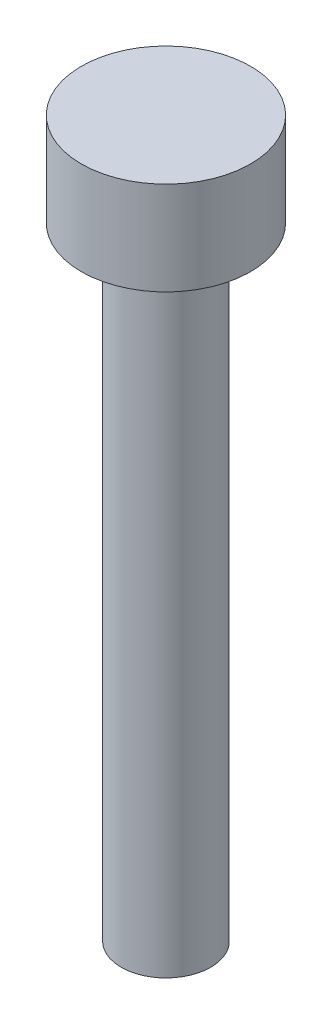
ISO-10303-21;
HEADER;
FILE_DESCRIPTION(('STEP AP214'),'2;1');
FILE_NAME('part.step','',(''),(''),'','','');
FILE_SCHEMA(('AUTOMOTIVE_DESIGN { 1 0 10303 214 1 1 1 1 }'));
ENDSEC;
DATA;
#1=APPLICATION_CONTEXT('core data for automotive mechanical design processes');
#2=APPLICATION_PROTOCOL_DEFINITION('international standard','automotive_design',2000,#1);
#3=PRODUCT_CONTEXT('',#1,'mechanical');
#4=PRODUCT('Part','Part','',(#3));
#5=PRODUCT_RELATED_PRODUCT_CATEGORY('part','',(#4));
#6=PRODUCT_DEFINITION_FORMATION('','',#4);
#7=PRODUCT_DEFINITION_CONTEXT('part definition',#1,'design');
#8=PRODUCT_DEFINITION('design','',#6,#7);
#9=PRODUCT_DEFINITION_SHAPE('','',#8);
#10=(LENGTH_UNIT() NAMED_UNIT(*) SI_UNIT(.MILLI.,.METRE.));
#11=(NAMED_UNIT(*) PLANE_ANGLE_UNIT() SI_UNIT($,.RADIAN.));
#12=(NAMED_UNIT(*) SI_UNIT($,.STERADIAN.) SOLID_ANGLE_UNIT());
#13=UNCERTAINTY_MEASURE_WITH_UNIT(LENGTH_MEASURE(1.E-05),#10,'distance_accuracy_value','');
#14=(GEOMETRIC_REPRESENTATION_CONTEXT(3) GLOBAL_UNCERTAINTY_ASSIGNED_CONTEXT((#13)) GLOBAL_UNIT_ASSIGNED_CONTEXT((#10,
#11,#12)) REPRESENTATION_CONTEXT('',''));
#15=CARTESIAN_POINT('',(0.,0.,0.));
#16=DIRECTION('',(0.,0.,1.));
#17=DIRECTION('',(1.,0.,0.));
#18=AXIS2_PLACEMENT_3D('',#15,#16,#17);
#19=CARTESIAN_POINT('',(0.,3.,0.));
#20=DIRECTION('',(0.,-1.,0.));
#21=DIRECTION('',(0.,0.,-1.));
#22=AXIS2_PLACEMENT_3D('',#19,#20,#21);
#23=CYLINDRICAL_SURFACE('',#22,2.72);
#24=CARTESIAN_POINT('',(0.,3.,0.));
#25=DIRECTION('',(0.,1.,0.));
#26=DIRECTION('',(0.,0.,1.));
#27=AXIS2_PLACEMENT_3D('',#24,#25,#26);
#28=CIRCLE('',#27,2.72);
#29=CARTESIAN_POINT('',(0.,3.,2.72));
#30=VERTEX_POINT('',#29);
#31=EDGE_CURVE('E39',#30,#30,#28,.T.);
#32=ORIENTED_EDGE('',*,*,#31,.F.);
#33=EDGE_LOOP('',(#32));
#34=FACE_BOUND('',#33,.T.);
#35=CARTESIAN_POINT('',(0.,0.,0.));
#36=DIRECTION('',(0.,1.,0.));
#37=DIRECTION('',(0.,0.,1.));
#38=AXIS2_PLACEMENT_3D('',#35,#36,#37);
#39=CIRCLE('',#38,2.72);
#40=CARTESIAN_POINT('',(0.,0.,2.72));
#41=VERTEX_POINT('',#40);
#42=EDGE_CURVE('E35',#41,#41,#39,.T.);
#43=ORIENTED_EDGE('',*,*,#42,.T.);
#44=EDGE_LOOP('',(#43));
#45=FACE_BOUND('',#44,.T.);
#46=ADVANCED_FACE('F32',(#34,#45),#23,.T.);
#47=CARTESIAN_POINT('',(0.,3.,0.));
#48=DIRECTION('',(0.,1.,0.));
#49=DIRECTION('',(0.,0.,1.));
#50=AXIS2_PLACEMENT_3D('',#47,#48,#49);
#51=PLANE('',#50);
#52=ORIENTED_EDGE('',*,*,#31,.T.);
#53=EDGE_LOOP('',(#52));
#54=FACE_BOUND('',#53,.T.);
#55=ADVANCED_FACE('F56',(#54),#51,.T.);
#56=CARTESIAN_POINT('',(0.,0.,0.));
#57=DIRECTION('',(0.,1.,0.));
#58=DIRECTION('',(0.,0.,1.));
#59=AXIS2_PLACEMENT_3D('',#56,#57,#58);
#60=PLANE('',#59);
#61=CARTESIAN_POINT('',(0.,0.,0.));
#62=DIRECTION('',(0.,-1.,0.));
#63=DIRECTION('',(0.,0.,-1.));
#64=AXIS2_PLACEMENT_3D('',#61,#62,#63);
#65=CIRCLE('',#64,1.44);
#66=CARTESIAN_POINT('',(0.,0.,-1.44));
#67=VERTEX_POINT('',#66);
#68=EDGE_CURVE('E10',#67,#67,#65,.T.);
#69=ORIENTED_EDGE('',*,*,#68,.F.);
#70=EDGE_LOOP('',(#69));
#71=FACE_BOUND('',#70,.T.);
#72=ORIENTED_EDGE('',*,*,#42,.F.);
#73=EDGE_LOOP('',(#72));
#74=FACE_BOUND('',#73,.T.);
#75=ADVANCED_FACE('F53',(#71,#74),#60,.F.);
#76=CARTESIAN_POINT('',(0.,-20.,0.));
#77=DIRECTION('',(0.,1.,0.));
#78=DIRECTION('',(0.,0.,1.));
#79=AXIS2_PLACEMENT_3D('',#76,#77,#78);
#80=CYLINDRICAL_SURFACE('',#79,1.44);
#81=CARTESIAN_POINT('',(0.,-20.,0.));
#82=DIRECTION('',(0.,-1.,0.));
#83=DIRECTION('',(0.,0.,-1.));
#84=AXIS2_PLACEMENT_3D('',#81,#82,#83);
#85=CIRCLE('',#84,1.44);
#86=CARTESIAN_POINT('',(0.,-20.,-1.44));
#87=VERTEX_POINT('',#86);
#88=EDGE_CURVE('E45',#87,#87,#85,.T.);
#89=ORIENTED_EDGE('',*,*,#88,.F.);
#90=EDGE_LOOP('',(#89));
#91=FACE_BOUND('',#90,.T.);
#92=ORIENTED_EDGE('',*,*,#68,.T.);
#93=EDGE_LOOP('',(#92));
#94=FACE_BOUND('',#93,.T.);
#95=ADVANCED_FACE('F55',(#91,#94),#80,.T.);
#96=CARTESIAN_POINT('',(0.,-20.,0.));
#97=DIRECTION('',(0.,-1.,0.));
#98=DIRECTION('',(0.,0.,-1.));
#99=AXIS2_PLACEMENT_3D('',#96,#97,#98);
#100=PLANE('',#99);
#101=ORIENTED_EDGE('',*,*,#88,.T.);
#102=EDGE_LOOP('',(#101));
#103=FACE_BOUND('',#102,.T.);
#104=ADVANCED_FACE('F62',(#103),#100,.T.);
#105=CLOSED_SHELL('',(#46,#55,#75,#95,#104));
#106=MANIFOLD_SOLID_BREP('B2',#105);
#107=ADVANCED_BREP_SHAPE_REPRESENTATION('',(#18,#106),#14);
#108=SHAPE_DEFINITION_REPRESENTATION(#9,#107);
ENDSEC;
END-ISO-10303-21;
